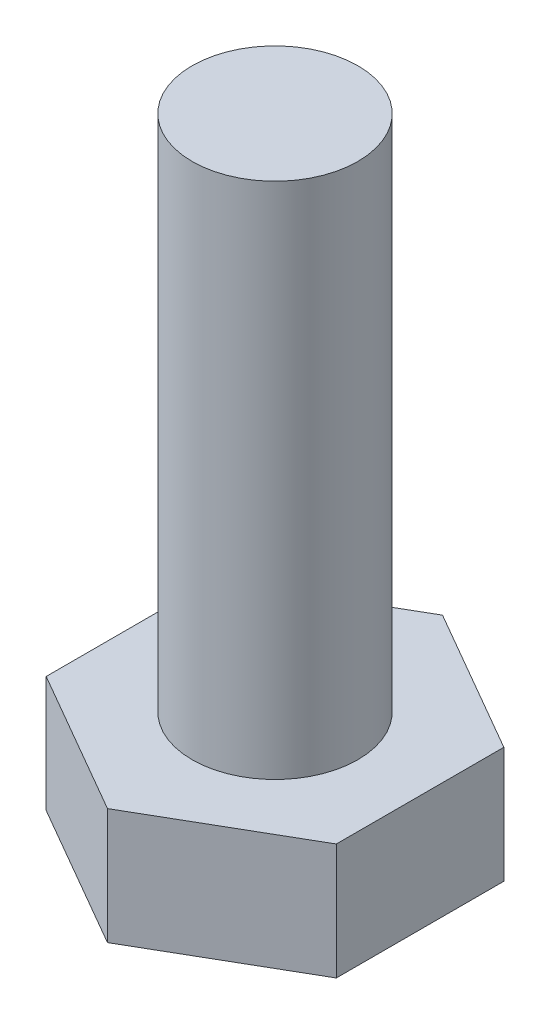
ISO-10303-21;
HEADER;
FILE_DESCRIPTION(('STEP AP214'),'2;1');
FILE_NAME('part.step','',(''),(''),'','','');
FILE_SCHEMA(('AUTOMOTIVE_DESIGN { 1 0 10303 214 1 1 1 1 }'));
ENDSEC;
DATA;
#1=APPLICATION_CONTEXT('core data for automotive mechanical design processes');
#2=APPLICATION_PROTOCOL_DEFINITION('international standard','automotive_design',2000,#1);
#3=PRODUCT_CONTEXT('',#1,'mechanical');
#4=PRODUCT('Part','Part','',(#3));
#5=PRODUCT_RELATED_PRODUCT_CATEGORY('part','',(#4));
#6=PRODUCT_DEFINITION_FORMATION('','',#4);
#7=PRODUCT_DEFINITION_CONTEXT('part definition',#1,'design');
#8=PRODUCT_DEFINITION('design','',#6,#7);
#9=PRODUCT_DEFINITION_SHAPE('','',#8);
#10=(LENGTH_UNIT() NAMED_UNIT(*) SI_UNIT(.MILLI.,.METRE.));
#11=(NAMED_UNIT(*) PLANE_ANGLE_UNIT() SI_UNIT($,.RADIAN.));
#12=(NAMED_UNIT(*) SI_UNIT($,.STERADIAN.) SOLID_ANGLE_UNIT());
#13=UNCERTAINTY_MEASURE_WITH_UNIT(LENGTH_MEASURE(1.E-05),#10,'distance_accuracy_value','');
#14=(GEOMETRIC_REPRESENTATION_CONTEXT(3) GLOBAL_UNCERTAINTY_ASSIGNED_CONTEXT((#13)) GLOBAL_UNIT_ASSIGNED_CONTEXT((#10,
#11,#12)) REPRESENTATION_CONTEXT('',''));
#15=CARTESIAN_POINT('',(0.,0.,0.));
#16=DIRECTION('',(0.,0.,1.));
#17=DIRECTION('',(1.,0.,0.));
#18=AXIS2_PLACEMENT_3D('',#15,#16,#17);
#19=CARTESIAN_POINT('',(6.99999999999994,5.6,-4.04145188432746));
#20=DIRECTION('',(-0.499999999999995,0.,0.866025403784442));
#21=DIRECTION('',(0.866025403784442,0.,0.499999999999995));
#22=AXIS2_PLACEMENT_3D('',#19,#20,#21);
#23=PLANE('',#22);
#24=DIRECTION('',(-0.866025403784442,0.,-0.499999999999995));
#25=VECTOR('',#24,1.);
#26=CARTESIAN_POINT('',(6.99999999999994,0.,-4.04145188432746));
#27=LINE('',#26,#25);
#28=CARTESIAN_POINT('',(6.99999999999994,0.,-4.04145188432746));
#29=VERTEX_POINT('',#28);
#30=CARTESIAN_POINT('',(0.,0.,-8.08290376865475));
#31=VERTEX_POINT('',#30);
#32=EDGE_CURVE('E117',#29,#31,#27,.T.);
#33=ORIENTED_EDGE('',*,*,#32,.T.);
#34=DIRECTION('',(0.,-1.,0.));
#35=VECTOR('',#34,1.);
#36=CARTESIAN_POINT('',(0.,5.6,-8.08290376865475));
#37=LINE('',#36,#35);
#38=CARTESIAN_POINT('',(0.,5.6,-8.08290376865475));
#39=VERTEX_POINT('',#38);
#40=EDGE_CURVE('E11',#39,#31,#37,.T.);
#41=ORIENTED_EDGE('',*,*,#40,.F.);
#42=DIRECTION('',(-0.866025403784442,0.,-0.499999999999995));
#43=VECTOR('',#42,1.);
#44=CARTESIAN_POINT('',(6.99999999999994,5.6,-4.04145188432746));
#45=LINE('',#44,#43);
#46=CARTESIAN_POINT('',(6.99999999999994,5.6,-4.04145188432746));
#47=VERTEX_POINT('',#46);
#48=EDGE_CURVE('E128',#47,#39,#45,.T.);
#49=ORIENTED_EDGE('',*,*,#48,.F.);
#50=DIRECTION('',(0.,-1.,0.));
#51=VECTOR('',#50,1.);
#52=CARTESIAN_POINT('',(6.99999999999994,5.6,-4.04145188432746));
#53=LINE('',#52,#51);
#54=EDGE_CURVE('E113',#47,#29,#53,.T.);
#55=ORIENTED_EDGE('',*,*,#54,.T.);
#56=EDGE_LOOP('',(#33,#41,#49,#55));
#57=FACE_BOUND('',#56,.T.);
#58=ADVANCED_FACE('F33',(#57),#23,.F.);
#59=CARTESIAN_POINT('',(0.,5.6,-8.08290376865475));
#60=DIRECTION('',(0.500000000000001,0.,0.866025403784438));
#61=DIRECTION('',(0.866025403784438,0.,-0.500000000000001));
#62=AXIS2_PLACEMENT_3D('',#59,#60,#61);
#63=PLANE('',#62);
#64=DIRECTION('',(-0.866025403784438,0.,0.500000000000001));
#65=VECTOR('',#64,1.);
#66=CARTESIAN_POINT('',(0.,0.,-8.08290376865475));
#67=LINE('',#66,#65);
#68=CARTESIAN_POINT('',(-7.,0.,-4.04145188432736));
#69=VERTEX_POINT('',#68);
#70=EDGE_CURVE('E120',#31,#69,#67,.T.);
#71=ORIENTED_EDGE('',*,*,#70,.T.);
#72=DIRECTION('',(0.,-1.,0.));
#73=VECTOR('',#72,1.);
#74=CARTESIAN_POINT('',(-7.,5.6,-4.04145188432736));
#75=LINE('',#74,#73);
#76=CARTESIAN_POINT('',(-7.,5.6,-4.04145188432736));
#77=VERTEX_POINT('',#76);
#78=EDGE_CURVE('E41',#77,#69,#75,.T.);
#79=ORIENTED_EDGE('',*,*,#78,.F.);
#80=DIRECTION('',(-0.866025403784438,0.,0.500000000000001));
#81=VECTOR('',#80,1.);
#82=CARTESIAN_POINT('',(0.,5.6,-8.08290376865475));
#83=LINE('',#82,#81);
#84=EDGE_CURVE('E86',#39,#77,#83,.T.);
#85=ORIENTED_EDGE('',*,*,#84,.F.);
#86=ORIENTED_EDGE('',*,*,#40,.T.);
#87=EDGE_LOOP('',(#71,#79,#85,#86));
#88=FACE_BOUND('',#87,.T.);
#89=ADVANCED_FACE('F153',(#88),#63,.F.);
#90=CARTESIAN_POINT('',(-7.,5.6,-4.04145188432736));
#91=DIRECTION('',(1.,0.,0.));
#92=DIRECTION('',(0.,0.,-1.));
#93=AXIS2_PLACEMENT_3D('',#90,#91,#92);
#94=PLANE('',#93);
#95=DIRECTION('',(0.,0.,1.));
#96=VECTOR('',#95,1.);
#97=CARTESIAN_POINT('',(-7.,0.,-4.04145188432736));
#98=LINE('',#97,#96);
#99=CARTESIAN_POINT('',(-6.99999999999997,0.,4.04145188432741));
#100=VERTEX_POINT('',#99);
#101=EDGE_CURVE('E123',#69,#100,#98,.T.);
#102=ORIENTED_EDGE('',*,*,#101,.T.);
#103=DIRECTION('',(0.,-1.,0.));
#104=VECTOR('',#103,1.);
#105=CARTESIAN_POINT('',(-6.99999999999997,5.6,4.04145188432741));
#106=LINE('',#105,#104);
#107=CARTESIAN_POINT('',(-6.99999999999997,5.6,4.04145188432741));
#108=VERTEX_POINT('',#107);
#109=EDGE_CURVE('E108',#108,#100,#106,.T.);
#110=ORIENTED_EDGE('',*,*,#109,.F.);
#111=DIRECTION('',(0.,0.,1.));
#112=VECTOR('',#111,1.);
#113=CARTESIAN_POINT('',(-7.,5.6,-4.04145188432736));
#114=LINE('',#113,#112);
#115=EDGE_CURVE('E99',#77,#108,#114,.T.);
#116=ORIENTED_EDGE('',*,*,#115,.F.);
#117=ORIENTED_EDGE('',*,*,#78,.T.);
#118=EDGE_LOOP('',(#102,#110,#116,#117));
#119=FACE_BOUND('',#118,.T.);
#120=ADVANCED_FACE('F134',(#119),#94,.F.);
#121=CARTESIAN_POINT('',(-6.99999999999997,5.6,4.04145188432741));
#122=DIRECTION('',(0.499999999999995,0.,-0.866025403784442));
#123=DIRECTION('',(-0.866025403784442,0.,-0.499999999999995));
#124=AXIS2_PLACEMENT_3D('',#121,#122,#123);
#125=PLANE('',#124);
#126=DIRECTION('',(0.866025403784442,0.,0.499999999999995));
#127=VECTOR('',#126,1.);
#128=CARTESIAN_POINT('',(-6.99999999999997,0.,4.04145188432741));
#129=LINE('',#128,#127);
#130=CARTESIAN_POINT('',(0.,0.,8.08290376865475));
#131=VERTEX_POINT('',#130);
#132=EDGE_CURVE('E107',#100,#131,#129,.T.);
#133=ORIENTED_EDGE('',*,*,#132,.T.);
#134=DIRECTION('',(0.,-1.,0.));
#135=VECTOR('',#134,1.);
#136=CARTESIAN_POINT('',(0.,5.6,8.08290376865475));
#137=LINE('',#136,#135);
#138=CARTESIAN_POINT('',(0.,5.6,8.08290376865475));
#139=VERTEX_POINT('',#138);
#140=EDGE_CURVE('E104',#139,#131,#137,.T.);
#141=ORIENTED_EDGE('',*,*,#140,.F.);
#142=DIRECTION('',(0.866025403784442,0.,0.499999999999995));
#143=VECTOR('',#142,1.);
#144=CARTESIAN_POINT('',(-6.99999999999997,5.6,4.04145188432741));
#145=LINE('',#144,#143);
#146=EDGE_CURVE('E93',#108,#139,#145,.T.);
#147=ORIENTED_EDGE('',*,*,#146,.F.);
#148=ORIENTED_EDGE('',*,*,#109,.T.);
#149=EDGE_LOOP('',(#133,#141,#147,#148));
#150=FACE_BOUND('',#149,.T.);
#151=ADVANCED_FACE('F105',(#150),#125,.F.);
#152=CARTESIAN_POINT('',(0.,5.6,8.08290376865475));
#153=DIRECTION('',(-0.500000000000007,0.,-0.866025403784435));
#154=DIRECTION('',(-0.866025403784435,0.,0.500000000000007));
#155=AXIS2_PLACEMENT_3D('',#152,#153,#154);
#156=PLANE('',#155);
#157=DIRECTION('',(0.866025403784435,0.,-0.500000000000007));
#158=VECTOR('',#157,1.);
#159=CARTESIAN_POINT('',(0.,0.,8.08290376865475));
#160=LINE('',#159,#158);
#161=CARTESIAN_POINT('',(7.00000000000003,0.,4.04145188432731));
#162=VERTEX_POINT('',#161);
#163=EDGE_CURVE('E72',#131,#162,#160,.T.);
#164=ORIENTED_EDGE('',*,*,#163,.T.);
#165=DIRECTION('',(0.,-1.,0.));
#166=VECTOR('',#165,1.);
#167=CARTESIAN_POINT('',(7.00000000000003,5.6,4.04145188432731));
#168=LINE('',#167,#166);
#169=CARTESIAN_POINT('',(7.00000000000003,5.6,4.04145188432731));
#170=VERTEX_POINT('',#169);
#171=EDGE_CURVE('E109',#170,#162,#168,.T.);
#172=ORIENTED_EDGE('',*,*,#171,.F.);
#173=DIRECTION('',(0.866025403784435,0.,-0.500000000000007));
#174=VECTOR('',#173,1.);
#175=CARTESIAN_POINT('',(0.,5.6,8.08290376865475));
#176=LINE('',#175,#174);
#177=EDGE_CURVE('E97',#139,#170,#176,.T.);
#178=ORIENTED_EDGE('',*,*,#177,.F.);
#179=ORIENTED_EDGE('',*,*,#140,.T.);
#180=EDGE_LOOP('',(#164,#172,#178,#179));
#181=FACE_BOUND('',#180,.T.);
#182=ADVANCED_FACE('F111',(#181),#156,.F.);
#183=CARTESIAN_POINT('',(7.00000000000003,5.6,4.04145188432731));
#184=DIRECTION('',(-1.,0.,0.));
#185=DIRECTION('',(0.,0.,1.));
#186=AXIS2_PLACEMENT_3D('',#183,#184,#185);
#187=PLANE('',#186);
#188=DIRECTION('',(0.,0.,-1.));
#189=VECTOR('',#188,1.);
#190=CARTESIAN_POINT('',(7.00000000000003,0.,4.04145188432731));
#191=LINE('',#190,#189);
#192=EDGE_CURVE('E78',#162,#29,#191,.T.);
#193=ORIENTED_EDGE('',*,*,#192,.T.);
#194=ORIENTED_EDGE('',*,*,#54,.F.);
#195=DIRECTION('',(0.,0.,-1.));
#196=VECTOR('',#195,1.);
#197=CARTESIAN_POINT('',(7.00000000000003,5.6,4.04145188432731));
#198=LINE('',#197,#196);
#199=EDGE_CURVE('E49',#170,#47,#198,.T.);
#200=ORIENTED_EDGE('',*,*,#199,.F.);
#201=ORIENTED_EDGE('',*,*,#171,.T.);
#202=EDGE_LOOP('',(#193,#194,#200,#201));
#203=FACE_BOUND('',#202,.T.);
#204=ADVANCED_FACE('F141',(#203),#187,.F.);
#205=CARTESIAN_POINT('',(0.,5.6,0.));
#206=DIRECTION('',(0.,1.,0.));
#207=DIRECTION('',(0.,0.,1.));
#208=AXIS2_PLACEMENT_3D('',#205,#206,#207);
#209=PLANE('',#208);
#210=CARTESIAN_POINT('',(0.,5.6,0.));
#211=DIRECTION('',(0.,1.,0.));
#212=DIRECTION('',(0.,0.,1.));
#213=AXIS2_PLACEMENT_3D('',#210,#211,#212);
#214=CIRCLE('',#213,4.);
#215=CARTESIAN_POINT('',(0.,5.6,4.));
#216=VERTEX_POINT('',#215);
#217=EDGE_CURVE('E214',#216,#216,#214,.T.);
#218=ORIENTED_EDGE('',*,*,#217,.F.);
#219=EDGE_LOOP('',(#218));
#220=FACE_BOUND('',#219,.T.);
#221=ORIENTED_EDGE('',*,*,#48,.T.);
#222=ORIENTED_EDGE('',*,*,#84,.T.);
#223=ORIENTED_EDGE('',*,*,#115,.T.);
#224=ORIENTED_EDGE('',*,*,#146,.T.);
#225=ORIENTED_EDGE('',*,*,#177,.T.);
#226=ORIENTED_EDGE('',*,*,#199,.T.);
#227=EDGE_LOOP('',(#221,#222,#223,#224,#225,#226));
#228=FACE_BOUND('',#227,.T.);
#229=ADVANCED_FACE('F95',(#220,#228),#209,.T.);
#230=CARTESIAN_POINT('',(0.,0.,0.));
#231=DIRECTION('',(0.,1.,0.));
#232=DIRECTION('',(0.,0.,1.));
#233=AXIS2_PLACEMENT_3D('',#230,#231,#232);
#234=PLANE('',#233);
#235=ORIENTED_EDGE('',*,*,#32,.F.);
#236=ORIENTED_EDGE('',*,*,#192,.F.);
#237=ORIENTED_EDGE('',*,*,#163,.F.);
#238=ORIENTED_EDGE('',*,*,#132,.F.);
#239=ORIENTED_EDGE('',*,*,#101,.F.);
#240=ORIENTED_EDGE('',*,*,#70,.F.);
#241=EDGE_LOOP('',(#235,#236,#237,#238,#239,#240));
#242=FACE_BOUND('',#241,.T.);
#243=ADVANCED_FACE('F137',(#242),#234,.F.);
#244=CARTESIAN_POINT('',(0.,30.6,0.));
#245=DIRECTION('',(0.,-1.,0.));
#246=DIRECTION('',(0.,0.,-1.));
#247=AXIS2_PLACEMENT_3D('',#244,#245,#246);
#248=CYLINDRICAL_SURFACE('',#247,4.);
#249=CARTESIAN_POINT('',(0.,30.6,0.));
#250=DIRECTION('',(0.,1.,0.));
#251=DIRECTION('',(0.,0.,1.));
#252=AXIS2_PLACEMENT_3D('',#249,#250,#251);
#253=CIRCLE('',#252,4.);
#254=CARTESIAN_POINT('',(0.,30.6,4.));
#255=VERTEX_POINT('',#254);
#256=EDGE_CURVE('E121',#255,#255,#253,.T.);
#257=ORIENTED_EDGE('',*,*,#256,.F.);
#258=EDGE_LOOP('',(#257));
#259=FACE_BOUND('',#258,.T.);
#260=ORIENTED_EDGE('',*,*,#217,.T.);
#261=EDGE_LOOP('',(#260));
#262=FACE_BOUND('',#261,.T.);
#263=ADVANCED_FACE('F185',(#259,#262),#248,.T.);
#264=CARTESIAN_POINT('',(0.,30.6,0.));
#265=DIRECTION('',(0.,1.,0.));
#266=DIRECTION('',(0.,0.,1.));
#267=AXIS2_PLACEMENT_3D('',#264,#265,#266);
#268=PLANE('',#267);
#269=ORIENTED_EDGE('',*,*,#256,.T.);
#270=EDGE_LOOP('',(#269));
#271=FACE_BOUND('',#270,.T.);
#272=ADVANCED_FACE('F198',(#271),#268,.T.);
#273=CLOSED_SHELL('',(#58,#89,#120,#151,#182,#204,#229,#243,#263,#272));
#274=MANIFOLD_SOLID_BREP('B2',#273);
#275=ADVANCED_BREP_SHAPE_REPRESENTATION('',(#18,#274),#14);
#276=SHAPE_DEFINITION_REPRESENTATION(#9,#275);
ENDSEC;
END-ISO-10303-21;
